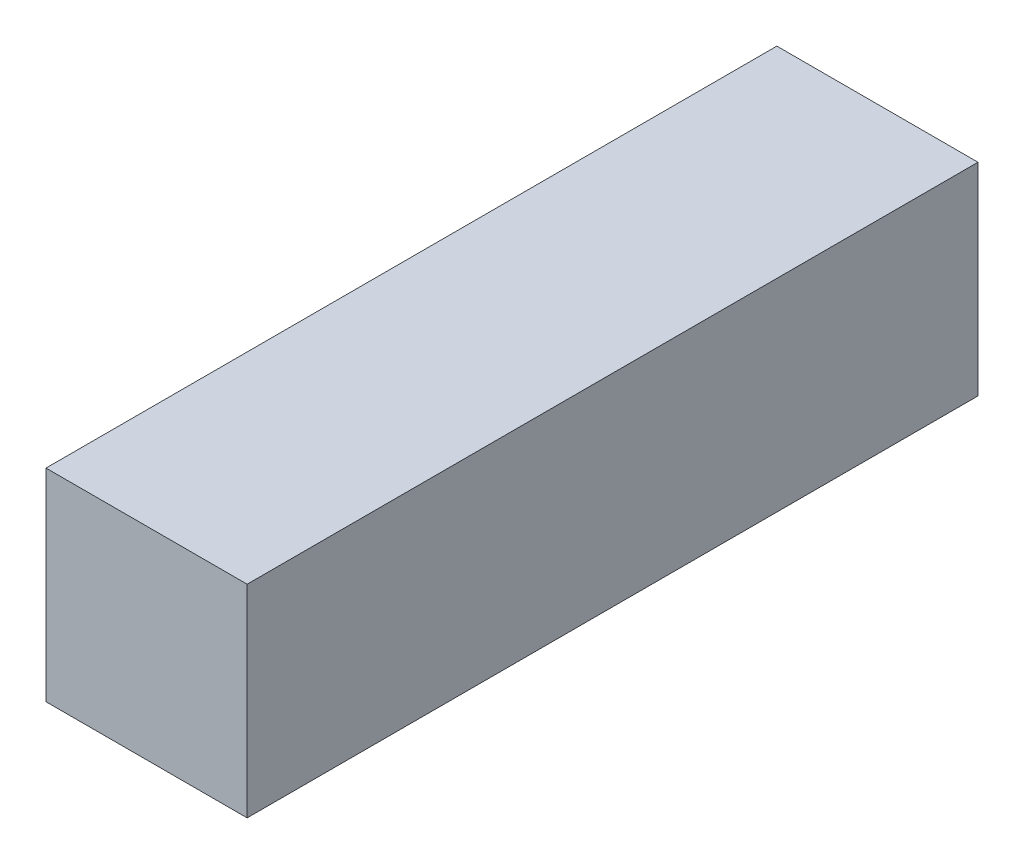
ISO-10303-21;
HEADER;
FILE_DESCRIPTION(('STEP AP214'),'2;1');
FILE_NAME('part.step','',(''),(''),'','','');
FILE_SCHEMA(('AUTOMOTIVE_DESIGN { 1 0 10303 214 1 1 1 1 }'));
ENDSEC;
DATA;
#1=APPLICATION_CONTEXT('core data for automotive mechanical design processes');
#2=APPLICATION_PROTOCOL_DEFINITION('international standard','automotive_design',2000,#1);
#3=PRODUCT_CONTEXT('',#1,'mechanical');
#4=PRODUCT('Part','Part','',(#3));
#5=PRODUCT_RELATED_PRODUCT_CATEGORY('part','',(#4));
#6=PRODUCT_DEFINITION_FORMATION('','',#4);
#7=PRODUCT_DEFINITION_CONTEXT('part definition',#1,'design');
#8=PRODUCT_DEFINITION('design','',#6,#7);
#9=PRODUCT_DEFINITION_SHAPE('','',#8);
#10=(LENGTH_UNIT() NAMED_UNIT(*) SI_UNIT(.MILLI.,.METRE.));
#11=(NAMED_UNIT(*) PLANE_ANGLE_UNIT() SI_UNIT($,.RADIAN.));
#12=(NAMED_UNIT(*) SI_UNIT($,.STERADIAN.) SOLID_ANGLE_UNIT());
#13=UNCERTAINTY_MEASURE_WITH_UNIT(LENGTH_MEASURE(1.E-05),#10,'distance_accuracy_value','');
#14=(GEOMETRIC_REPRESENTATION_CONTEXT(3) GLOBAL_UNCERTAINTY_ASSIGNED_CONTEXT((#13)) GLOBAL_UNIT_ASSIGNED_CONTEXT((#10,
#11,#12)) REPRESENTATION_CONTEXT('',''));
#15=CARTESIAN_POINT('',(0.,0.,0.));
#16=DIRECTION('',(0.,0.,1.));
#17=DIRECTION('',(1.,0.,0.));
#18=AXIS2_PLACEMENT_3D('',#15,#16,#17);
#19=CARTESIAN_POINT('',(16.1,-16.2,117.));
#20=DIRECTION('',(-1.,0.,0.));
#21=DIRECTION('',(0.,0.,1.));
#22=AXIS2_PLACEMENT_3D('',#19,#20,#21);
#23=PLANE('',#22);
#24=DIRECTION('',(0.,1.,0.));
#25=VECTOR('',#24,1.);
#26=CARTESIAN_POINT('',(16.1,-16.2,0.));
#27=LINE('',#26,#25);
#28=CARTESIAN_POINT('',(16.1,-16.2,0.));
#29=VERTEX_POINT('',#28);
#30=CARTESIAN_POINT('',(16.1,16.2,0.));
#31=VERTEX_POINT('',#30);
#32=EDGE_CURVE('E96',#29,#31,#27,.T.);
#33=ORIENTED_EDGE('',*,*,#32,.T.);
#34=DIRECTION('',(0.,0.,-1.));
#35=VECTOR('',#34,1.);
#36=CARTESIAN_POINT('',(16.1,16.2,117.));
#37=LINE('',#36,#35);
#38=CARTESIAN_POINT('',(16.1,16.2,117.));
#39=VERTEX_POINT('',#38);
#40=EDGE_CURVE('E11',#39,#31,#37,.T.);
#41=ORIENTED_EDGE('',*,*,#40,.F.);
#42=DIRECTION('',(0.,1.,0.));
#43=VECTOR('',#42,1.);
#44=CARTESIAN_POINT('',(16.1,-16.2,117.));
#45=LINE('',#44,#43);
#46=CARTESIAN_POINT('',(16.1,-16.2,117.));
#47=VERTEX_POINT('',#46);
#48=EDGE_CURVE('E84',#47,#39,#45,.T.);
#49=ORIENTED_EDGE('',*,*,#48,.F.);
#50=DIRECTION('',(0.,0.,-1.));
#51=VECTOR('',#50,1.);
#52=CARTESIAN_POINT('',(16.1,-16.2,117.));
#53=LINE('',#52,#51);
#54=EDGE_CURVE('E92',#47,#29,#53,.T.);
#55=ORIENTED_EDGE('',*,*,#54,.T.);
#56=EDGE_LOOP('',(#33,#41,#49,#55));
#57=FACE_BOUND('',#56,.T.);
#58=ADVANCED_FACE('F33',(#57),#23,.F.);
#59=CARTESIAN_POINT('',(-16.1,16.2,117.));
#60=DIRECTION('',(0.,-1.,0.));
#61=DIRECTION('',(0.,0.,-1.));
#62=AXIS2_PLACEMENT_3D('',#59,#60,#61);
#63=PLANE('',#62);
#64=DIRECTION('',(-1.,0.,0.));
#65=VECTOR('',#64,1.);
#66=CARTESIAN_POINT('',(-16.1,16.2,0.));
#67=LINE('',#66,#65);
#68=CARTESIAN_POINT('',(-16.1,16.2,0.));
#69=VERTEX_POINT('',#68);
#70=EDGE_CURVE('E88',#31,#69,#67,.T.);
#71=ORIENTED_EDGE('',*,*,#70,.T.);
#72=DIRECTION('',(0.,0.,-1.));
#73=VECTOR('',#72,1.);
#74=CARTESIAN_POINT('',(-16.1,16.2,117.));
#75=LINE('',#74,#73);
#76=CARTESIAN_POINT('',(-16.1,16.2,117.));
#77=VERTEX_POINT('',#76);
#78=EDGE_CURVE('E41',#77,#69,#75,.T.);
#79=ORIENTED_EDGE('',*,*,#78,.F.);
#80=DIRECTION('',(-1.,0.,0.));
#81=VECTOR('',#80,1.);
#82=CARTESIAN_POINT('',(-16.1,16.2,117.));
#83=LINE('',#82,#81);
#84=EDGE_CURVE('E79',#39,#77,#83,.T.);
#85=ORIENTED_EDGE('',*,*,#84,.F.);
#86=ORIENTED_EDGE('',*,*,#40,.T.);
#87=EDGE_LOOP('',(#71,#79,#85,#86));
#88=FACE_BOUND('',#87,.T.);
#89=ADVANCED_FACE('F87',(#88),#63,.F.);
#90=CARTESIAN_POINT('',(-16.1,-16.2,117.));
#91=DIRECTION('',(1.,0.,0.));
#92=DIRECTION('',(0.,0.,-1.));
#93=AXIS2_PLACEMENT_3D('',#90,#91,#92);
#94=PLANE('',#93);
#95=DIRECTION('',(0.,-1.,0.));
#96=VECTOR('',#95,1.);
#97=CARTESIAN_POINT('',(-16.1,-16.2,0.));
#98=LINE('',#97,#96);
#99=CARTESIAN_POINT('',(-16.1,-16.2,0.));
#100=VERTEX_POINT('',#99);
#101=EDGE_CURVE('E66',#69,#100,#98,.T.);
#102=ORIENTED_EDGE('',*,*,#101,.T.);
#103=DIRECTION('',(0.,0.,-1.));
#104=VECTOR('',#103,1.);
#105=CARTESIAN_POINT('',(-16.1,-16.2,117.));
#106=LINE('',#105,#104);
#107=CARTESIAN_POINT('',(-16.1,-16.2,117.));
#108=VERTEX_POINT('',#107);
#109=EDGE_CURVE('E89',#108,#100,#106,.T.);
#110=ORIENTED_EDGE('',*,*,#109,.F.);
#111=DIRECTION('',(0.,-1.,0.));
#112=VECTOR('',#111,1.);
#113=CARTESIAN_POINT('',(-16.1,-16.2,117.));
#114=LINE('',#113,#112);
#115=EDGE_CURVE('E82',#77,#108,#114,.T.);
#116=ORIENTED_EDGE('',*,*,#115,.F.);
#117=ORIENTED_EDGE('',*,*,#78,.T.);
#118=EDGE_LOOP('',(#102,#110,#116,#117));
#119=FACE_BOUND('',#118,.T.);
#120=ADVANCED_FACE('F90',(#119),#94,.F.);
#121=CARTESIAN_POINT('',(-16.1,-16.2,117.));
#122=DIRECTION('',(0.,1.,0.));
#123=DIRECTION('',(0.,0.,1.));
#124=AXIS2_PLACEMENT_3D('',#121,#122,#123);
#125=PLANE('',#124);
#126=DIRECTION('',(1.,0.,0.));
#127=VECTOR('',#126,1.);
#128=CARTESIAN_POINT('',(-16.1,-16.2,0.));
#129=LINE('',#128,#127);
#130=EDGE_CURVE('E72',#100,#29,#129,.T.);
#131=ORIENTED_EDGE('',*,*,#130,.T.);
#132=ORIENTED_EDGE('',*,*,#54,.F.);
#133=DIRECTION('',(1.,0.,0.));
#134=VECTOR('',#133,1.);
#135=CARTESIAN_POINT('',(-16.1,-16.2,117.));
#136=LINE('',#135,#134);
#137=EDGE_CURVE('E49',#108,#47,#136,.T.);
#138=ORIENTED_EDGE('',*,*,#137,.F.);
#139=ORIENTED_EDGE('',*,*,#109,.T.);
#140=EDGE_LOOP('',(#131,#132,#138,#139));
#141=FACE_BOUND('',#140,.T.);
#142=ADVANCED_FACE('F103',(#141),#125,.F.);
#143=CARTESIAN_POINT('',(0.,0.,117.));
#144=DIRECTION('',(0.,0.,-1.));
#145=DIRECTION('',(-1.,0.,0.));
#146=AXIS2_PLACEMENT_3D('',#143,#144,#145);
#147=PLANE('',#146);
#148=ORIENTED_EDGE('',*,*,#48,.T.);
#149=ORIENTED_EDGE('',*,*,#84,.T.);
#150=ORIENTED_EDGE('',*,*,#115,.T.);
#151=ORIENTED_EDGE('',*,*,#137,.T.);
#152=EDGE_LOOP('',(#148,#149,#150,#151));
#153=FACE_BOUND('',#152,.T.);
#154=ADVANCED_FACE('F80',(#153),#147,.F.);
#155=CARTESIAN_POINT('',(0.,0.,0.));
#156=DIRECTION('',(0.,0.,-1.));
#157=DIRECTION('',(-1.,0.,0.));
#158=AXIS2_PLACEMENT_3D('',#155,#156,#157);
#159=PLANE('',#158);
#160=ORIENTED_EDGE('',*,*,#32,.F.);
#161=ORIENTED_EDGE('',*,*,#130,.F.);
#162=ORIENTED_EDGE('',*,*,#101,.F.);
#163=ORIENTED_EDGE('',*,*,#70,.F.);
#164=EDGE_LOOP('',(#160,#161,#162,#163));
#165=FACE_BOUND('',#164,.T.);
#166=ADVANCED_FACE('F106',(#165),#159,.T.);
#167=CLOSED_SHELL('',(#58,#89,#120,#142,#154,#166));
#168=MANIFOLD_SOLID_BREP('B2',#167);
#169=ADVANCED_BREP_SHAPE_REPRESENTATION('',(#18,#168),#14);
#170=SHAPE_DEFINITION_REPRESENTATION(#9,#169);
ENDSEC;
END-ISO-10303-21;
